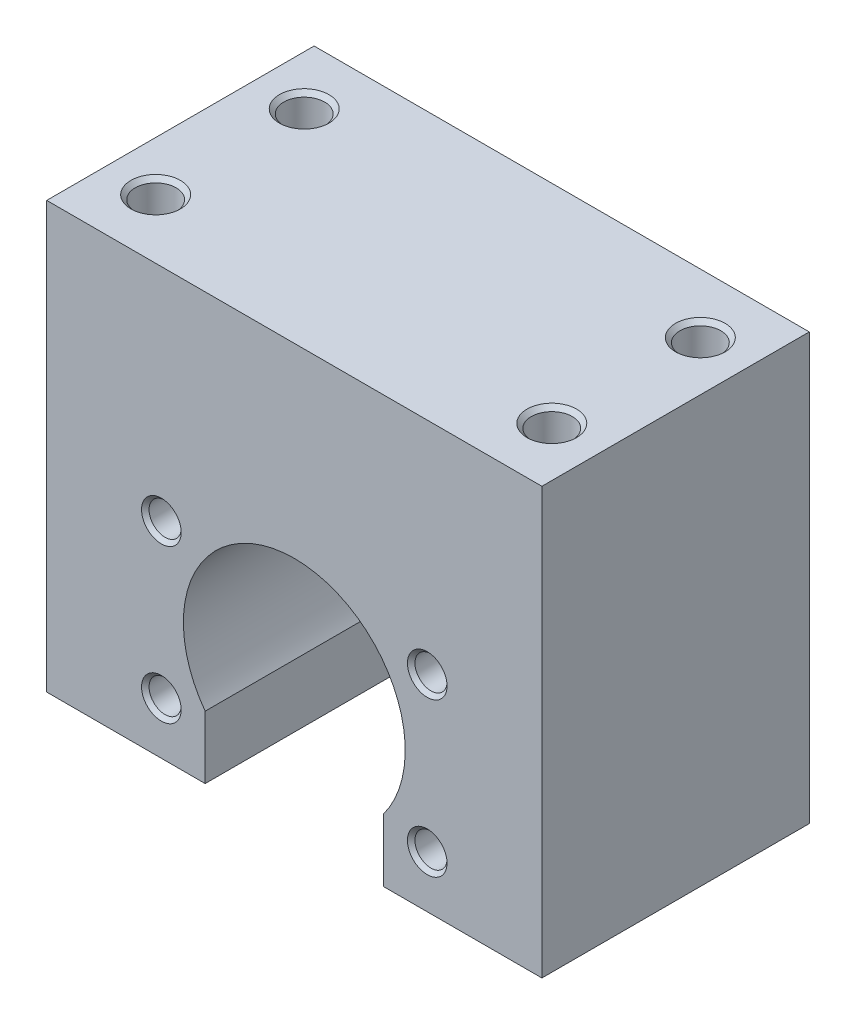
ISO-10303-21;
HEADER;
FILE_DESCRIPTION(('STEP AP214'),'2;1');
FILE_NAME('part.step','',(''),(''),'','','');
FILE_SCHEMA(('AUTOMOTIVE_DESIGN { 1 0 10303 214 1 1 1 1 }'));
ENDSEC;
DATA;
#1=APPLICATION_CONTEXT('core data for automotive mechanical design processes');
#2=APPLICATION_PROTOCOL_DEFINITION('international standard','automotive_design',2000,#1);
#3=PRODUCT_CONTEXT('',#1,'mechanical');
#4=PRODUCT('Part','Part','',(#3));
#5=PRODUCT_RELATED_PRODUCT_CATEGORY('part','',(#4));
#6=PRODUCT_DEFINITION_FORMATION('','',#4);
#7=PRODUCT_DEFINITION_CONTEXT('part definition',#1,'design');
#8=PRODUCT_DEFINITION('design','',#6,#7);
#9=PRODUCT_DEFINITION_SHAPE('','',#8);
#10=(LENGTH_UNIT() NAMED_UNIT(*) SI_UNIT(.MILLI.,.METRE.));
#11=(NAMED_UNIT(*) PLANE_ANGLE_UNIT() SI_UNIT($,.RADIAN.));
#12=(NAMED_UNIT(*) SI_UNIT($,.STERADIAN.) SOLID_ANGLE_UNIT());
#13=UNCERTAINTY_MEASURE_WITH_UNIT(LENGTH_MEASURE(1.E-05),#10,'distance_accuracy_value','');
#14=(GEOMETRIC_REPRESENTATION_CONTEXT(3) GLOBAL_UNCERTAINTY_ASSIGNED_CONTEXT((#13)) GLOBAL_UNIT_ASSIGNED_CONTEXT((#10,
#11,#12)) REPRESENTATION_CONTEXT('',''));
#15=CARTESIAN_POINT('',(0.,0.,0.));
#16=DIRECTION('',(0.,0.,1.));
#17=DIRECTION('',(1.,0.,0.));
#18=AXIS2_PLACEMENT_3D('',#15,#16,#17);
#19=CARTESIAN_POINT('',(13.4233937586588,7.75,5.09999999991351));
#20=DIRECTION('',(0.,0.,1.));
#21=DIRECTION('',(1.,0.,0.));
#22=AXIS2_PLACEMENT_3D('',#19,#20,#21);
#23=CONICAL_SURFACE('',#22,1.62099999988927,1.04719755106381);
#24=CARTESIAN_POINT('',(13.4233937586588,7.75,4.16411521354121));
#25=VERTEX_POINT('',#24);
#26=VERTEX_LOOP('',#25);
#27=FACE_BOUND('',#26,.T.);
#28=CARTESIAN_POINT('',(13.4233937586588,7.75,5.1));
#29=DIRECTION('',(0.,0.,-1.));
#30=DIRECTION('',(-1.,0.,0.));
#31=AXIS2_PLACEMENT_3D('',#28,#29,#30);
#32=CIRCLE('',#31,1.621);
#33=CARTESIAN_POINT('',(11.8023937586588,7.75,5.1));
#34=VERTEX_POINT('',#33);
#35=EDGE_CURVE('E208',#34,#34,#32,.F.);
#36=ORIENTED_EDGE('',*,*,#35,.T.);
#37=EDGE_LOOP('',(#36));
#38=FACE_BOUND('',#37,.T.);
#39=ADVANCED_FACE('F15',(#27,#38),#23,.F.);
#40=CARTESIAN_POINT('',(-13.4233937586588,-7.75,5.10000000002719));
#41=DIRECTION('',(0.,0.,1.));
#42=DIRECTION('',(1.,0.,0.));
#43=AXIS2_PLACEMENT_3D('',#40,#41,#42);
#44=CONICAL_SURFACE('',#43,1.62099999995522,1.04719755119714);
#45=CARTESIAN_POINT('',(-13.4233937586588,-7.75,4.16411521376858));
#46=VERTEX_POINT('',#45);
#47=VERTEX_LOOP('',#46);
#48=FACE_BOUND('',#47,.T.);
#49=CARTESIAN_POINT('',(-13.4233937586588,-7.75,5.1));
#50=DIRECTION('',(0.,0.,-1.));
#51=DIRECTION('',(-1.,0.,0.));
#52=AXIS2_PLACEMENT_3D('',#49,#50,#51);
#53=CIRCLE('',#52,1.621);
#54=CARTESIAN_POINT('',(-15.0443937586588,-7.75,5.1));
#55=VERTEX_POINT('',#54);
#56=EDGE_CURVE('E205',#55,#55,#53,.F.);
#57=ORIENTED_EDGE('',*,*,#56,.T.);
#58=EDGE_LOOP('',(#57));
#59=FACE_BOUND('',#58,.T.);
#60=ADVANCED_FACE('F253',(#48,#59),#44,.F.);
#61=CARTESIAN_POINT('',(13.4233937586588,-7.75,5.09999999997035));
#62=DIRECTION('',(0.,0.,1.));
#63=DIRECTION('',(1.,0.,0.));
#64=AXIS2_PLACEMENT_3D('',#61,#62,#63);
#65=CONICAL_SURFACE('',#64,1.6209999999385,1.04719755118681);
#66=CARTESIAN_POINT('',(13.4233937586588,-7.75,4.1641152136549));
#67=VERTEX_POINT('',#66);
#68=VERTEX_LOOP('',#67);
#69=FACE_BOUND('',#68,.T.);
#70=CARTESIAN_POINT('',(13.4233937586588,-7.75,5.1));
#71=DIRECTION('',(0.,0.,-1.));
#72=DIRECTION('',(-1.,0.,0.));
#73=AXIS2_PLACEMENT_3D('',#70,#71,#72);
#74=CIRCLE('',#73,1.621);
#75=CARTESIAN_POINT('',(11.8023937586588,-7.75,5.1));
#76=VERTEX_POINT('',#75);
#77=EDGE_CURVE('E202',#76,#76,#74,.F.);
#78=ORIENTED_EDGE('',*,*,#77,.T.);
#79=EDGE_LOOP('',(#78));
#80=FACE_BOUND('',#79,.T.);
#81=ADVANCED_FACE('F259',(#69,#80),#65,.F.);
#82=CARTESIAN_POINT('',(-13.4233937586588,7.75,5.10000000002719));
#83=DIRECTION('',(0.,0.,1.));
#84=DIRECTION('',(1.,0.,0.));
#85=AXIS2_PLACEMENT_3D('',#82,#83,#84);
#86=CONICAL_SURFACE('',#85,1.62099999995522,1.04719755119714);
#87=CARTESIAN_POINT('',(-13.4233937586588,7.75,4.16411521376858));
#88=VERTEX_POINT('',#87);
#89=VERTEX_LOOP('',#88);
#90=FACE_BOUND('',#89,.T.);
#91=CARTESIAN_POINT('',(-13.4233937586588,7.75,5.1));
#92=DIRECTION('',(0.,0.,-1.));
#93=DIRECTION('',(-1.,0.,0.));
#94=AXIS2_PLACEMENT_3D('',#91,#92,#93);
#95=CIRCLE('',#94,1.621);
#96=CARTESIAN_POINT('',(-15.0443937586588,7.75,5.1));
#97=VERTEX_POINT('',#96);
#98=EDGE_CURVE('E199',#97,#97,#95,.F.);
#99=ORIENTED_EDGE('',*,*,#98,.T.);
#100=EDGE_LOOP('',(#99));
#101=FACE_BOUND('',#100,.T.);
#102=ADVANCED_FACE('F365',(#90,#101),#86,.F.);
#103=CARTESIAN_POINT('',(20.,18.0000000000291,-7.5));
#104=DIRECTION('',(0.,1.,0.));
#105=DIRECTION('',(0.,0.,1.));
#106=AXIS2_PLACEMENT_3D('',#103,#104,#105);
#107=CONICAL_SURFACE('',#106,2.06699999994726,1.04719755119768);
#108=CARTESIAN_POINT('',(20.,16.8066169935912,-7.50000000013529));
#109=VERTEX_POINT('',#108);
#110=VERTEX_LOOP('',#109);
#111=FACE_BOUND('',#110,.T.);
#112=CARTESIAN_POINT('',(20.,18.,-7.5));
#113=DIRECTION('',(0.,-1.,0.));
#114=DIRECTION('',(0.,0.,-1.));
#115=AXIS2_PLACEMENT_3D('',#112,#113,#114);
#116=CIRCLE('',#115,2.067);
#117=CARTESIAN_POINT('',(20.,18.,-9.567));
#118=VERTEX_POINT('',#117);
#119=EDGE_CURVE('E196',#118,#118,#116,.F.);
#120=ORIENTED_EDGE('',*,*,#119,.T.);
#121=EDGE_LOOP('',(#120));
#122=FACE_BOUND('',#121,.T.);
#123=ADVANCED_FACE('F361',(#111,#122),#107,.F.);
#124=CARTESIAN_POINT('',(20.,18.0000000000291,7.5));
#125=DIRECTION('',(0.,1.,0.));
#126=DIRECTION('',(0.,0.,1.));
#127=AXIS2_PLACEMENT_3D('',#124,#125,#126);
#128=CONICAL_SURFACE('',#127,2.06699999994726,1.04719755119768);
#129=CARTESIAN_POINT('',(20.,16.8066169935912,7.50000000013529));
#130=VERTEX_POINT('',#129);
#131=VERTEX_LOOP('',#130);
#132=FACE_BOUND('',#131,.T.);
#133=CARTESIAN_POINT('',(20.,18.,7.5));
#134=DIRECTION('',(0.,1.,0.));
#135=DIRECTION('',(0.,0.,1.));
#136=AXIS2_PLACEMENT_3D('',#133,#134,#135);
#137=CIRCLE('',#136,2.067);
#138=CARTESIAN_POINT('',(20.,18.,9.567));
#139=VERTEX_POINT('',#138);
#140=EDGE_CURVE('E193',#139,#139,#137,.T.);
#141=ORIENTED_EDGE('',*,*,#140,.T.);
#142=EDGE_LOOP('',(#141));
#143=FACE_BOUND('',#142,.T.);
#144=ADVANCED_FACE('F357',(#132,#143),#128,.F.);
#145=CARTESIAN_POINT('',(-20.,18.0000000000291,-7.5));
#146=DIRECTION('',(0.,1.,0.));
#147=DIRECTION('',(0.,0.,1.));
#148=AXIS2_PLACEMENT_3D('',#145,#146,#147);
#149=CONICAL_SURFACE('',#148,2.06699999994726,1.04719755119768);
#150=CARTESIAN_POINT('',(-20.,16.8066169935912,-7.50000000013529));
#151=VERTEX_POINT('',#150);
#152=VERTEX_LOOP('',#151);
#153=FACE_BOUND('',#152,.T.);
#154=CARTESIAN_POINT('',(-20.,18.,-7.5));
#155=DIRECTION('',(0.,-1.,0.));
#156=DIRECTION('',(0.,0.,-1.));
#157=AXIS2_PLACEMENT_3D('',#154,#155,#156);
#158=CIRCLE('',#157,2.067);
#159=CARTESIAN_POINT('',(-20.,18.,-9.567));
#160=VERTEX_POINT('',#159);
#161=EDGE_CURVE('E190',#160,#160,#158,.F.);
#162=ORIENTED_EDGE('',*,*,#161,.T.);
#163=EDGE_LOOP('',(#162));
#164=FACE_BOUND('',#163,.T.);
#165=ADVANCED_FACE('F353',(#153,#164),#149,.F.);
#166=CARTESIAN_POINT('',(-20.,18.0000000000291,7.5));
#167=DIRECTION('',(0.,1.,0.));
#168=DIRECTION('',(0.,0.,1.));
#169=AXIS2_PLACEMENT_3D('',#166,#167,#168);
#170=CONICAL_SURFACE('',#169,2.06699999994726,1.04719755119768);
#171=CARTESIAN_POINT('',(-20.,16.8066169935912,7.50000000013529));
#172=VERTEX_POINT('',#171);
#173=VERTEX_LOOP('',#172);
#174=FACE_BOUND('',#173,.T.);
#175=CARTESIAN_POINT('',(-20.,18.,7.5));
#176=DIRECTION('',(0.,1.,0.));
#177=DIRECTION('',(0.,0.,1.));
#178=AXIS2_PLACEMENT_3D('',#175,#176,#177);
#179=CIRCLE('',#178,2.067);
#180=CARTESIAN_POINT('',(-20.,18.,9.567));
#181=VERTEX_POINT('',#180);
#182=EDGE_CURVE('E187',#181,#181,#179,.T.);
#183=ORIENTED_EDGE('',*,*,#182,.T.);
#184=EDGE_LOOP('',(#183));
#185=FACE_BOUND('',#184,.T.);
#186=ADVANCED_FACE('F248',(#174,#185),#170,.F.);
#187=CARTESIAN_POINT('',(13.4233937586588,7.75,9.1105));
#188=DIRECTION('',(0.,0.,-1.));
#189=DIRECTION('',(-1.,0.,0.));
#190=AXIS2_PLACEMENT_3D('',#187,#188,#189);
#191=CYLINDRICAL_SURFACE('',#190,1.621);
#192=CARTESIAN_POINT('',(13.4233937586588,7.75,13.1210000000124));
#193=DIRECTION('',(0.,0.,1.));
#194=DIRECTION('',(-0.866025403782762,-0.500000000002904,0.));
#195=AXIS2_PLACEMENT_3D('',#192,#193,#194);
#196=CIRCLE('',#195,1.62100000001615);
#197=CARTESIAN_POINT('',(12.019566579113,6.93949999998722,13.1210000000124));
#198=VERTEX_POINT('',#197);
#199=EDGE_CURVE('E184',#198,#198,#196,.T.);
#200=ORIENTED_EDGE('',*,*,#199,.T.);
#201=EDGE_LOOP('',(#200));
#202=FACE_BOUND('',#201,.T.);
#203=ORIENTED_EDGE('',*,*,#35,.F.);
#204=EDGE_LOOP('',(#203));
#205=FACE_BOUND('',#204,.T.);
#206=ADVANCED_FACE('F244',(#202,#205),#191,.F.);
#207=CARTESIAN_POINT('',(-13.4233937586588,-7.75,9.1105));
#208=DIRECTION('',(0.,0.,-1.));
#209=DIRECTION('',(-1.,0.,0.));
#210=AXIS2_PLACEMENT_3D('',#207,#208,#209);
#211=CYLINDRICAL_SURFACE('',#210,1.621);
#212=CARTESIAN_POINT('',(-13.4233937586588,-7.75,13.1209999999555));
#213=DIRECTION('',(0.,0.,1.));
#214=DIRECTION('',(-0.866025403784687,-0.49999999999957,0.));
#215=AXIS2_PLACEMENT_3D('',#212,#213,#214);
#216=CIRCLE('',#215,1.62099999997602);
#217=CARTESIAN_POINT('',(-14.827220938173,-8.56049999998731,13.1209999999555));
#218=VERTEX_POINT('',#217);
#219=EDGE_CURVE('E181',#218,#218,#216,.T.);
#220=ORIENTED_EDGE('',*,*,#219,.T.);
#221=EDGE_LOOP('',(#220));
#222=FACE_BOUND('',#221,.T.);
#223=ORIENTED_EDGE('',*,*,#56,.F.);
#224=EDGE_LOOP('',(#223));
#225=FACE_BOUND('',#224,.T.);
#226=ADVANCED_FACE('F247',(#222,#225),#211,.F.);
#227=CARTESIAN_POINT('',(13.4233937586588,-7.75,9.1105));
#228=DIRECTION('',(0.,0.,-1.));
#229=DIRECTION('',(-1.,0.,0.));
#230=AXIS2_PLACEMENT_3D('',#227,#228,#229);
#231=CYLINDRICAL_SURFACE('',#230,1.621);
#232=CARTESIAN_POINT('',(13.4233937586588,-7.75,13.1210000000124));
#233=DIRECTION('',(0.,0.,1.));
#234=DIRECTION('',(-0.866025403782762,0.500000000002904,0.));
#235=AXIS2_PLACEMENT_3D('',#232,#233,#234);
#236=CIRCLE('',#235,1.62100000001615);
#237=CARTESIAN_POINT('',(12.019566579113,-6.93949999998722,13.1210000000124));
#238=VERTEX_POINT('',#237);
#239=EDGE_CURVE('E178',#238,#238,#236,.T.);
#240=ORIENTED_EDGE('',*,*,#239,.T.);
#241=EDGE_LOOP('',(#240));
#242=FACE_BOUND('',#241,.T.);
#243=ORIENTED_EDGE('',*,*,#77,.F.);
#244=EDGE_LOOP('',(#243));
#245=FACE_BOUND('',#244,.T.);
#246=ADVANCED_FACE('F343',(#242,#245),#231,.F.);
#247=CARTESIAN_POINT('',(-13.4233937586588,7.75,9.1105));
#248=DIRECTION('',(0.,0.,-1.));
#249=DIRECTION('',(-1.,0.,0.));
#250=AXIS2_PLACEMENT_3D('',#247,#248,#249);
#251=CYLINDRICAL_SURFACE('',#250,1.621);
#252=CARTESIAN_POINT('',(-13.4233937586588,7.75,13.1209999999555));
#253=DIRECTION('',(0.,0.,1.));
#254=DIRECTION('',(-0.866025403784687,0.49999999999957,0.));
#255=AXIS2_PLACEMENT_3D('',#252,#253,#254);
#256=CIRCLE('',#255,1.62099999997602);
#257=CARTESIAN_POINT('',(-14.827220938173,8.56049999998731,13.1209999999555));
#258=VERTEX_POINT('',#257);
#259=EDGE_CURVE('E175',#258,#258,#256,.T.);
#260=ORIENTED_EDGE('',*,*,#259,.T.);
#261=EDGE_LOOP('',(#260));
#262=FACE_BOUND('',#261,.T.);
#263=ORIENTED_EDGE('',*,*,#98,.F.);
#264=EDGE_LOOP('',(#263));
#265=FACE_BOUND('',#264,.T.);
#266=ADVANCED_FACE('F339',(#262,#265),#251,.F.);
#267=CARTESIAN_POINT('',(20.,23.7835,-7.5));
#268=DIRECTION('',(0.,-1.,0.));
#269=DIRECTION('',(0.,0.,-1.));
#270=AXIS2_PLACEMENT_3D('',#267,#268,#269);
#271=CYLINDRICAL_SURFACE('',#270,2.067);
#272=CARTESIAN_POINT('',(20.,29.5669999999291,-7.5));
#273=DIRECTION('',(0.,1.,0.));
#274=DIRECTION('',(0.,0.,-1.));
#275=AXIS2_PLACEMENT_3D('',#272,#273,#274);
#276=CIRCLE('',#275,2.06699999994726);
#277=CARTESIAN_POINT('',(20.,29.5669999999291,-9.56699999994726));
#278=VERTEX_POINT('',#277);
#279=EDGE_CURVE('E172',#278,#278,#276,.T.);
#280=ORIENTED_EDGE('',*,*,#279,.T.);
#281=EDGE_LOOP('',(#280));
#282=FACE_BOUND('',#281,.T.);
#283=ORIENTED_EDGE('',*,*,#119,.F.);
#284=EDGE_LOOP('',(#283));
#285=FACE_BOUND('',#284,.T.);
#286=ADVANCED_FACE('F335',(#282,#285),#271,.F.);
#287=CARTESIAN_POINT('',(20.,23.7835,7.5));
#288=DIRECTION('',(0.,1.,0.));
#289=DIRECTION('',(0.,0.,1.));
#290=AXIS2_PLACEMENT_3D('',#287,#288,#289);
#291=CYLINDRICAL_SURFACE('',#290,2.067);
#292=CARTESIAN_POINT('',(20.,29.5669999999291,7.5));
#293=DIRECTION('',(0.,1.,0.));
#294=DIRECTION('',(0.,0.,1.));
#295=AXIS2_PLACEMENT_3D('',#292,#293,#294);
#296=CIRCLE('',#295,2.06699999994726);
#297=CARTESIAN_POINT('',(20.,29.5669999999291,9.56699999994726));
#298=VERTEX_POINT('',#297);
#299=EDGE_CURVE('E169',#298,#298,#296,.T.);
#300=ORIENTED_EDGE('',*,*,#299,.T.);
#301=EDGE_LOOP('',(#300));
#302=FACE_BOUND('',#301,.T.);
#303=ORIENTED_EDGE('',*,*,#140,.F.);
#304=EDGE_LOOP('',(#303));
#305=FACE_BOUND('',#304,.T.);
#306=ADVANCED_FACE('F331',(#302,#305),#291,.F.);
#307=CARTESIAN_POINT('',(-20.,23.7835,-7.5));
#308=DIRECTION('',(0.,-1.,0.));
#309=DIRECTION('',(0.,0.,-1.));
#310=AXIS2_PLACEMENT_3D('',#307,#308,#309);
#311=CYLINDRICAL_SURFACE('',#310,2.067);
#312=CARTESIAN_POINT('',(-20.,29.5669999999291,-7.5));
#313=DIRECTION('',(0.,1.,0.));
#314=DIRECTION('',(0.,0.,-1.));
#315=AXIS2_PLACEMENT_3D('',#312,#313,#314);
#316=CIRCLE('',#315,2.06699999994726);
#317=CARTESIAN_POINT('',(-20.,29.5669999999291,-9.56699999994726));
#318=VERTEX_POINT('',#317);
#319=EDGE_CURVE('E166',#318,#318,#316,.T.);
#320=ORIENTED_EDGE('',*,*,#319,.T.);
#321=EDGE_LOOP('',(#320));
#322=FACE_BOUND('',#321,.T.);
#323=ORIENTED_EDGE('',*,*,#161,.F.);
#324=EDGE_LOOP('',(#323));
#325=FACE_BOUND('',#324,.T.);
#326=ADVANCED_FACE('F327',(#322,#325),#311,.F.);
#327=CARTESIAN_POINT('',(-20.,23.7835,7.5));
#328=DIRECTION('',(0.,1.,0.));
#329=DIRECTION('',(0.,0.,1.));
#330=AXIS2_PLACEMENT_3D('',#327,#328,#329);
#331=CYLINDRICAL_SURFACE('',#330,2.067);
#332=CARTESIAN_POINT('',(-20.,29.5669999999291,7.5));
#333=DIRECTION('',(0.,1.,0.));
#334=DIRECTION('',(0.,0.,1.));
#335=AXIS2_PLACEMENT_3D('',#332,#333,#334);
#336=CIRCLE('',#335,2.06699999994726);
#337=CARTESIAN_POINT('',(-20.,29.5669999999291,9.56699999994726));
#338=VERTEX_POINT('',#337);
#339=EDGE_CURVE('E163',#338,#338,#336,.T.);
#340=ORIENTED_EDGE('',*,*,#339,.T.);
#341=EDGE_LOOP('',(#340));
#342=FACE_BOUND('',#341,.T.);
#343=ORIENTED_EDGE('',*,*,#182,.F.);
#344=EDGE_LOOP('',(#343));
#345=FACE_BOUND('',#344,.T.);
#346=ADVANCED_FACE('F240',(#342,#345),#331,.F.);
#347=CARTESIAN_POINT('',(13.4233937586588,7.75,13.499999999965));
#348=DIRECTION('',(0.,0.,1.));
#349=DIRECTION('',(0.,-1.,0.));
#350=AXIS2_PLACEMENT_3D('',#347,#348,#349);
#351=CONICAL_SURFACE('',#350,1.99999999991365,0.785398163352202);
#352=CARTESIAN_POINT('',(13.4233937586588,7.75,13.5000000000218));
#353=DIRECTION('',(0.,0.,1.));
#354=DIRECTION('',(0.,-1.,0.));
#355=AXIS2_PLACEMENT_3D('',#352,#353,#354);
#356=CIRCLE('',#355,1.9999999999705);
#357=CARTESIAN_POINT('',(13.4233937586588,5.7500000000295,13.5000000000218));
#358=VERTEX_POINT('',#357);
#359=EDGE_CURVE('E18',#358,#358,#356,.F.);
#360=ORIENTED_EDGE('',*,*,#359,.F.);
#361=EDGE_LOOP('',(#360));
#362=FACE_BOUND('',#361,.T.);
#363=ORIENTED_EDGE('',*,*,#199,.F.);
#364=EDGE_LOOP('',(#363));
#365=FACE_BOUND('',#364,.T.);
#366=ADVANCED_FACE('F236',(#362,#365),#351,.F.);
#367=CARTESIAN_POINT('',(-13.4233937586588,-7.75,13.499999999965));
#368=DIRECTION('',(0.,0.,1.));
#369=DIRECTION('',(0.,-1.,0.));
#370=AXIS2_PLACEMENT_3D('',#367,#368,#369);
#371=CONICAL_SURFACE('',#370,2.00000000000041,0.785398163417146);
#372=CARTESIAN_POINT('',(-13.4233937586588,-7.75,13.499999999965));
#373=DIRECTION('',(0.,0.,1.));
#374=DIRECTION('',(0.,-1.,0.));
#375=AXIS2_PLACEMENT_3D('',#372,#373,#374);
#376=CIRCLE('',#375,2.00000000000041);
#377=CARTESIAN_POINT('',(-13.4233937586588,-9.75000000000041,13.499999999965));
#378=VERTEX_POINT('',#377);
#379=EDGE_CURVE('E228',#378,#378,#376,.F.);
#380=ORIENTED_EDGE('',*,*,#379,.F.);
#381=EDGE_LOOP('',(#380));
#382=FACE_BOUND('',#381,.T.);
#383=ORIENTED_EDGE('',*,*,#219,.F.);
#384=EDGE_LOOP('',(#383));
#385=FACE_BOUND('',#384,.T.);
#386=ADVANCED_FACE('F239',(#382,#385),#371,.F.);
#387=CARTESIAN_POINT('',(13.4233937586588,-7.75,13.499999999965));
#388=DIRECTION('',(0.,0.,1.));
#389=DIRECTION('',(0.,-1.,0.));
#390=AXIS2_PLACEMENT_3D('',#387,#388,#389);
#391=CONICAL_SURFACE('',#390,1.99999999991365,0.785398163352202);
#392=CARTESIAN_POINT('',(13.4233937586588,-7.75,13.5000000000218));
#393=DIRECTION('',(0.,0.,1.));
#394=DIRECTION('',(0.,-1.,0.));
#395=AXIS2_PLACEMENT_3D('',#392,#393,#394);
#396=CIRCLE('',#395,1.9999999999705);
#397=CARTESIAN_POINT('',(13.4233937586588,-9.7499999999705,13.5000000000218));
#398=VERTEX_POINT('',#397);
#399=EDGE_CURVE('E226',#398,#398,#396,.F.);
#400=ORIENTED_EDGE('',*,*,#399,.F.);
#401=EDGE_LOOP('',(#400));
#402=FACE_BOUND('',#401,.T.);
#403=ORIENTED_EDGE('',*,*,#239,.F.);
#404=EDGE_LOOP('',(#403));
#405=FACE_BOUND('',#404,.T.);
#406=ADVANCED_FACE('F317',(#402,#405),#391,.F.);
#407=CARTESIAN_POINT('',(-13.4233937586588,7.75,13.499999999965));
#408=DIRECTION('',(0.,0.,1.));
#409=DIRECTION('',(0.,-1.,0.));
#410=AXIS2_PLACEMENT_3D('',#407,#408,#409);
#411=CONICAL_SURFACE('',#410,2.00000000000041,0.785398163417146);
#412=CARTESIAN_POINT('',(-13.4233937586588,7.75,13.499999999965));
#413=DIRECTION('',(0.,0.,1.));
#414=DIRECTION('',(0.,-1.,0.));
#415=AXIS2_PLACEMENT_3D('',#412,#413,#414);
#416=CIRCLE('',#415,2.00000000000041);
#417=CARTESIAN_POINT('',(-13.4233937586588,5.74999999999959,13.499999999965));
#418=VERTEX_POINT('',#417);
#419=EDGE_CURVE('E123',#418,#418,#416,.F.);
#420=ORIENTED_EDGE('',*,*,#419,.F.);
#421=EDGE_LOOP('',(#420));
#422=FACE_BOUND('',#421,.T.);
#423=ORIENTED_EDGE('',*,*,#259,.F.);
#424=EDGE_LOOP('',(#423));
#425=FACE_BOUND('',#424,.T.);
#426=ADVANCED_FACE('F313',(#422,#425),#411,.F.);
#427=CARTESIAN_POINT('',(20.,29.999999999859,-7.5));
#428=DIRECTION('',(0.,1.,0.));
#429=DIRECTION('',(-1.,0.,0.));
#430=AXIS2_PLACEMENT_3D('',#427,#428,#429);
#431=CONICAL_SURFACE('',#430,2.49999999987722,0.785398163397448);
#432=CARTESIAN_POINT('',(20.,29.9999999999727,-7.5));
#433=DIRECTION('',(0.,1.,0.));
#434=DIRECTION('',(-1.,0.,0.));
#435=AXIS2_PLACEMENT_3D('',#432,#433,#434);
#436=CIRCLE('',#435,2.49999999999091);
#437=CARTESIAN_POINT('',(17.5000000000091,29.9999999999727,-7.5));
#438=VERTEX_POINT('',#437);
#439=EDGE_CURVE('E221',#438,#438,#436,.F.);
#440=ORIENTED_EDGE('',*,*,#439,.F.);
#441=EDGE_LOOP('',(#440));
#442=FACE_BOUND('',#441,.T.);
#443=ORIENTED_EDGE('',*,*,#279,.F.);
#444=EDGE_LOOP('',(#443));
#445=FACE_BOUND('',#444,.T.);
#446=ADVANCED_FACE('F309',(#442,#445),#431,.F.);
#447=CARTESIAN_POINT('',(20.,29.999999999859,7.5));
#448=DIRECTION('',(0.,1.,0.));
#449=DIRECTION('',(-1.,0.,0.));
#450=AXIS2_PLACEMENT_3D('',#447,#448,#449);
#451=CONICAL_SURFACE('',#450,2.49999999987722,0.785398163397448);
#452=CARTESIAN_POINT('',(20.,29.9999999999727,7.5));
#453=DIRECTION('',(0.,1.,0.));
#454=DIRECTION('',(-1.,0.,0.));
#455=AXIS2_PLACEMENT_3D('',#452,#453,#454);
#456=CIRCLE('',#455,2.49999999999091);
#457=CARTESIAN_POINT('',(17.5000000000091,29.9999999999727,7.5));
#458=VERTEX_POINT('',#457);
#459=EDGE_CURVE('E218',#458,#458,#456,.F.);
#460=ORIENTED_EDGE('',*,*,#459,.F.);
#461=EDGE_LOOP('',(#460));
#462=FACE_BOUND('',#461,.T.);
#463=ORIENTED_EDGE('',*,*,#299,.F.);
#464=EDGE_LOOP('',(#463));
#465=FACE_BOUND('',#464,.T.);
#466=ADVANCED_FACE('F305',(#462,#465),#451,.F.);
#467=CARTESIAN_POINT('',(-20.,29.999999999859,-7.5));
#468=DIRECTION('',(0.,1.,0.));
#469=DIRECTION('',(-1.,0.,0.));
#470=AXIS2_PLACEMENT_3D('',#467,#468,#469);
#471=CONICAL_SURFACE('',#470,2.49999999987722,0.785398163397448);
#472=CARTESIAN_POINT('',(-20.,29.9999999999727,-7.5));
#473=DIRECTION('',(0.,1.,0.));
#474=DIRECTION('',(-1.,0.,0.));
#475=AXIS2_PLACEMENT_3D('',#472,#473,#474);
#476=CIRCLE('',#475,2.49999999999091);
#477=CARTESIAN_POINT('',(-22.4999999999909,29.9999999999727,-7.5));
#478=VERTEX_POINT('',#477);
#479=EDGE_CURVE('E215',#478,#478,#476,.F.);
#480=ORIENTED_EDGE('',*,*,#479,.F.);
#481=EDGE_LOOP('',(#480));
#482=FACE_BOUND('',#481,.T.);
#483=ORIENTED_EDGE('',*,*,#319,.F.);
#484=EDGE_LOOP('',(#483));
#485=FACE_BOUND('',#484,.T.);
#486=ADVANCED_FACE('F301',(#482,#485),#471,.F.);
#487=CARTESIAN_POINT('',(-20.,29.999999999859,7.5));
#488=DIRECTION('',(0.,1.,0.));
#489=DIRECTION('',(-1.,0.,0.));
#490=AXIS2_PLACEMENT_3D('',#487,#488,#489);
#491=CONICAL_SURFACE('',#490,2.49999999987722,0.785398163397448);
#492=CARTESIAN_POINT('',(-20.,29.9999999999727,7.5));
#493=DIRECTION('',(0.,1.,0.));
#494=DIRECTION('',(-1.,0.,0.));
#495=AXIS2_PLACEMENT_3D('',#492,#493,#494);
#496=CIRCLE('',#495,2.49999999999091);
#497=CARTESIAN_POINT('',(-22.4999999999909,29.9999999999727,7.5));
#498=VERTEX_POINT('',#497);
#499=EDGE_CURVE('E151',#498,#498,#496,.F.);
#500=ORIENTED_EDGE('',*,*,#499,.F.);
#501=EDGE_LOOP('',(#500));
#502=FACE_BOUND('',#501,.T.);
#503=ORIENTED_EDGE('',*,*,#339,.F.);
#504=EDGE_LOOP('',(#503));
#505=FACE_BOUND('',#504,.T.);
#506=ADVANCED_FACE('F298',(#502,#505),#491,.F.);
#507=CARTESIAN_POINT('',(0.,0.,13.5));
#508=DIRECTION('',(0.,0.,1.));
#509=DIRECTION('',(1.,0.,0.));
#510=AXIS2_PLACEMENT_3D('',#507,#508,#509);
#511=PLANE('',#510);
#512=DIRECTION('',(1.,0.,0.));
#513=VECTOR('',#512,1.);
#514=CARTESIAN_POINT('',(25.,30.,13.5));
#515=LINE('',#514,#513);
#516=CARTESIAN_POINT('',(-25.,30.,13.5));
#517=VERTEX_POINT('',#516);
#518=CARTESIAN_POINT('',(25.,30.,13.5));
#519=VERTEX_POINT('',#518);
#520=EDGE_CURVE('E149',#517,#519,#515,.T.);
#521=ORIENTED_EDGE('',*,*,#520,.F.);
#522=DIRECTION('',(0.,1.,0.));
#523=VECTOR('',#522,1.);
#524=CARTESIAN_POINT('',(-25.,30.,13.5));
#525=LINE('',#524,#523);
#526=CARTESIAN_POINT('',(-25.,-13.,13.5));
#527=VERTEX_POINT('',#526);
#528=EDGE_CURVE('E144',#527,#517,#525,.T.);
#529=ORIENTED_EDGE('',*,*,#528,.F.);
#530=DIRECTION('',(1.,0.,0.));
#531=VECTOR('',#530,1.);
#532=CARTESIAN_POINT('',(-25.,-13.,13.5));
#533=LINE('',#532,#531);
#534=CARTESIAN_POINT('',(-9.,-13.,13.5));
#535=VERTEX_POINT('',#534);
#536=EDGE_CURVE('E134',#535,#527,#533,.F.);
#537=ORIENTED_EDGE('',*,*,#536,.F.);
#538=DIRECTION('',(0.,1.,0.));
#539=VECTOR('',#538,1.);
#540=CARTESIAN_POINT('',(-9.,-13.,13.5));
#541=LINE('',#540,#539);
#542=CARTESIAN_POINT('',(-9.,-6.66633332499958,13.5));
#543=VERTEX_POINT('',#542);
#544=EDGE_CURVE('E119',#543,#535,#541,.F.);
#545=ORIENTED_EDGE('',*,*,#544,.F.);
#546=CARTESIAN_POINT('',(0.,0.,13.5));
#547=DIRECTION('',(0.,0.,1.));
#548=DIRECTION('',(1.,0.,0.));
#549=AXIS2_PLACEMENT_3D('',#546,#547,#548);
#550=CIRCLE('',#549,11.2);
#551=CARTESIAN_POINT('',(9.,-6.66633332499958,13.5));
#552=VERTEX_POINT('',#551);
#553=EDGE_CURVE('E111',#543,#552,#550,.F.);
#554=ORIENTED_EDGE('',*,*,#553,.T.);
#555=DIRECTION('',(0.,1.,0.));
#556=VECTOR('',#555,1.);
#557=CARTESIAN_POINT('',(9.,-6.66633332499958,13.5));
#558=LINE('',#557,#556);
#559=CARTESIAN_POINT('',(9.,-13.,13.5));
#560=VERTEX_POINT('',#559);
#561=EDGE_CURVE('E101',#560,#552,#558,.T.);
#562=ORIENTED_EDGE('',*,*,#561,.F.);
#563=DIRECTION('',(1.,0.,0.));
#564=VECTOR('',#563,1.);
#565=CARTESIAN_POINT('',(9.,-13.,13.5));
#566=LINE('',#565,#564);
#567=CARTESIAN_POINT('',(25.,-13.,13.5));
#568=VERTEX_POINT('',#567);
#569=EDGE_CURVE('E127',#568,#560,#566,.F.);
#570=ORIENTED_EDGE('',*,*,#569,.F.);
#571=DIRECTION('',(0.,1.,0.));
#572=VECTOR('',#571,1.);
#573=CARTESIAN_POINT('',(25.,-13.,13.5));
#574=LINE('',#573,#572);
#575=EDGE_CURVE('E154',#519,#568,#574,.F.);
#576=ORIENTED_EDGE('',*,*,#575,.F.);
#577=EDGE_LOOP('',(#521,#529,#537,#545,#554,#562,#570,#576));
#578=FACE_BOUND('',#577,.T.);
#579=ORIENTED_EDGE('',*,*,#419,.T.);
#580=EDGE_LOOP('',(#579));
#581=FACE_BOUND('',#580,.T.);
#582=ORIENTED_EDGE('',*,*,#399,.T.);
#583=EDGE_LOOP('',(#582));
#584=FACE_BOUND('',#583,.T.);
#585=ORIENTED_EDGE('',*,*,#379,.T.);
#586=EDGE_LOOP('',(#585));
#587=FACE_BOUND('',#586,.T.);
#588=ORIENTED_EDGE('',*,*,#359,.T.);
#589=EDGE_LOOP('',(#588));
#590=FACE_BOUND('',#589,.T.);
#591=ADVANCED_FACE('F116',(#578,#581,#584,#587,#590),#511,.T.);
#592=CARTESIAN_POINT('',(0.,0.,13.5));
#593=DIRECTION('',(0.,0.,1.));
#594=DIRECTION('',(1.,0.,0.));
#595=AXIS2_PLACEMENT_3D('',#592,#593,#594);
#596=CYLINDRICAL_SURFACE('',#595,11.2);
#597=CARTESIAN_POINT('',(0.,0.,-13.5));
#598=DIRECTION('',(0.,0.,1.));
#599=DIRECTION('',(1.,0.,0.));
#600=AXIS2_PLACEMENT_3D('',#597,#598,#599);
#601=CIRCLE('',#600,11.2);
#602=CARTESIAN_POINT('',(-9.,-6.66633332499958,-13.5));
#603=VERTEX_POINT('',#602);
#604=CARTESIAN_POINT('',(9.,-6.66633332499958,-13.5));
#605=VERTEX_POINT('',#604);
#606=EDGE_CURVE('E126',#603,#605,#601,.F.);
#607=ORIENTED_EDGE('',*,*,#606,.T.);
#608=DIRECTION('',(0.,0.,1.));
#609=VECTOR('',#608,1.);
#610=CARTESIAN_POINT('',(9.,-6.66633332499958,13.5));
#611=LINE('',#610,#609);
#612=EDGE_CURVE('E106',#552,#605,#611,.F.);
#613=ORIENTED_EDGE('',*,*,#612,.F.);
#614=ORIENTED_EDGE('',*,*,#553,.F.);
#615=DIRECTION('',(0.,0.,-1.));
#616=VECTOR('',#615,1.);
#617=CARTESIAN_POINT('',(-9.,-6.66633332499958,13.5));
#618=LINE('',#617,#616);
#619=EDGE_CURVE('E141',#603,#543,#618,.F.);
#620=ORIENTED_EDGE('',*,*,#619,.F.);
#621=EDGE_LOOP('',(#607,#613,#614,#620));
#622=FACE_BOUND('',#621,.T.);
#623=ADVANCED_FACE('F125',(#622),#596,.F.);
#624=CARTESIAN_POINT('',(9.,-6.66633332499958,13.5));
#625=DIRECTION('',(-1.,0.,0.));
#626=DIRECTION('',(0.,0.,1.));
#627=AXIS2_PLACEMENT_3D('',#624,#625,#626);
#628=PLANE('',#627);
#629=ORIENTED_EDGE('',*,*,#561,.T.);
#630=ORIENTED_EDGE('',*,*,#612,.T.);
#631=DIRECTION('',(0.,1.,0.));
#632=VECTOR('',#631,1.);
#633=CARTESIAN_POINT('',(9.,0.,-13.5));
#634=LINE('',#633,#632);
#635=CARTESIAN_POINT('',(9.,-13.,-13.5));
#636=VERTEX_POINT('',#635);
#637=EDGE_CURVE('E212',#605,#636,#634,.F.);
#638=ORIENTED_EDGE('',*,*,#637,.T.);
#639=DIRECTION('',(0.,0.,-1.));
#640=VECTOR('',#639,1.);
#641=CARTESIAN_POINT('',(9.,-13.,13.5));
#642=LINE('',#641,#640);
#643=EDGE_CURVE('E108',#560,#636,#642,.T.);
#644=ORIENTED_EDGE('',*,*,#643,.F.);
#645=EDGE_LOOP('',(#629,#630,#638,#644));
#646=FACE_BOUND('',#645,.T.);
#647=ADVANCED_FACE('F103',(#646),#628,.T.);
#648=CARTESIAN_POINT('',(9.,-13.,13.5));
#649=DIRECTION('',(0.,-1.,0.));
#650=DIRECTION('',(0.,0.,-1.));
#651=AXIS2_PLACEMENT_3D('',#648,#649,#650);
#652=PLANE('',#651);
#653=ORIENTED_EDGE('',*,*,#569,.T.);
#654=ORIENTED_EDGE('',*,*,#643,.T.);
#655=DIRECTION('',(1.,0.,0.));
#656=VECTOR('',#655,1.);
#657=CARTESIAN_POINT('',(0.,-13.,-13.5));
#658=LINE('',#657,#656);
#659=CARTESIAN_POINT('',(25.,-13.,-13.5));
#660=VERTEX_POINT('',#659);
#661=EDGE_CURVE('E750',#636,#660,#658,.T.);
#662=ORIENTED_EDGE('',*,*,#661,.T.);
#663=DIRECTION('',(0.,0.,-1.));
#664=VECTOR('',#663,1.);
#665=CARTESIAN_POINT('',(25.,-13.,13.5));
#666=LINE('',#665,#664);
#667=EDGE_CURVE('E156',#568,#660,#666,.T.);
#668=ORIENTED_EDGE('',*,*,#667,.F.);
#669=EDGE_LOOP('',(#653,#654,#662,#668));
#670=FACE_BOUND('',#669,.T.);
#671=ADVANCED_FACE('F287',(#670),#652,.T.);
#672=CARTESIAN_POINT('',(25.,-13.,13.5));
#673=DIRECTION('',(1.,0.,0.));
#674=DIRECTION('',(0.,0.,-1.));
#675=AXIS2_PLACEMENT_3D('',#672,#673,#674);
#676=PLANE('',#675);
#677=ORIENTED_EDGE('',*,*,#575,.T.);
#678=ORIENTED_EDGE('',*,*,#667,.T.);
#679=DIRECTION('',(0.,1.,0.));
#680=VECTOR('',#679,1.);
#681=CARTESIAN_POINT('',(25.,0.,-13.5));
#682=LINE('',#681,#680);
#683=CARTESIAN_POINT('',(25.,30.,-13.5));
#684=VERTEX_POINT('',#683);
#685=EDGE_CURVE('E738',#660,#684,#682,.T.);
#686=ORIENTED_EDGE('',*,*,#685,.T.);
#687=DIRECTION('',(0.,0.,1.));
#688=VECTOR('',#687,1.);
#689=CARTESIAN_POINT('',(25.,30.,13.5));
#690=LINE('',#689,#688);
#691=EDGE_CURVE('E146',#519,#684,#690,.F.);
#692=ORIENTED_EDGE('',*,*,#691,.F.);
#693=EDGE_LOOP('',(#677,#678,#686,#692));
#694=FACE_BOUND('',#693,.T.);
#695=ADVANCED_FACE('F283',(#694),#676,.T.);
#696=CARTESIAN_POINT('',(25.,30.,13.5));
#697=DIRECTION('',(0.,1.,0.));
#698=DIRECTION('',(0.,0.,1.));
#699=AXIS2_PLACEMENT_3D('',#696,#697,#698);
#700=PLANE('',#699);
#701=ORIENTED_EDGE('',*,*,#520,.T.);
#702=ORIENTED_EDGE('',*,*,#691,.T.);
#703=DIRECTION('',(1.,0.,0.));
#704=VECTOR('',#703,1.);
#705=CARTESIAN_POINT('',(0.,30.,-13.5));
#706=LINE('',#705,#704);
#707=CARTESIAN_POINT('',(-25.,30.,-13.5));
#708=VERTEX_POINT('',#707);
#709=EDGE_CURVE('E749',#684,#708,#706,.F.);
#710=ORIENTED_EDGE('',*,*,#709,.T.);
#711=DIRECTION('',(0.,0.,1.));
#712=VECTOR('',#711,1.);
#713=CARTESIAN_POINT('',(-25.,30.,13.5));
#714=LINE('',#713,#712);
#715=EDGE_CURVE('E137',#517,#708,#714,.F.);
#716=ORIENTED_EDGE('',*,*,#715,.F.);
#717=EDGE_LOOP('',(#701,#702,#710,#716));
#718=FACE_BOUND('',#717,.T.);
#719=ORIENTED_EDGE('',*,*,#499,.T.);
#720=EDGE_LOOP('',(#719));
#721=FACE_BOUND('',#720,.T.);
#722=ORIENTED_EDGE('',*,*,#479,.T.);
#723=EDGE_LOOP('',(#722));
#724=FACE_BOUND('',#723,.T.);
#725=ORIENTED_EDGE('',*,*,#459,.T.);
#726=EDGE_LOOP('',(#725));
#727=FACE_BOUND('',#726,.T.);
#728=ORIENTED_EDGE('',*,*,#439,.T.);
#729=EDGE_LOOP('',(#728));
#730=FACE_BOUND('',#729,.T.);
#731=ADVANCED_FACE('F279',(#718,#721,#724,#727,#730),#700,.T.);
#732=CARTESIAN_POINT('',(-25.,30.,13.5));
#733=DIRECTION('',(-1.,0.,0.));
#734=DIRECTION('',(0.,0.,1.));
#735=AXIS2_PLACEMENT_3D('',#732,#733,#734);
#736=PLANE('',#735);
#737=ORIENTED_EDGE('',*,*,#528,.T.);
#738=ORIENTED_EDGE('',*,*,#715,.T.);
#739=DIRECTION('',(0.,1.,0.));
#740=VECTOR('',#739,1.);
#741=CARTESIAN_POINT('',(-25.,0.,-13.5));
#742=LINE('',#741,#740);
#743=CARTESIAN_POINT('',(-25.,-13.,-13.5));
#744=VERTEX_POINT('',#743);
#745=EDGE_CURVE('E770',#708,#744,#742,.F.);
#746=ORIENTED_EDGE('',*,*,#745,.T.);
#747=DIRECTION('',(0.,0.,-1.));
#748=VECTOR('',#747,1.);
#749=CARTESIAN_POINT('',(-25.,-13.,13.5));
#750=LINE('',#749,#748);
#751=EDGE_CURVE('E136',#527,#744,#750,.T.);
#752=ORIENTED_EDGE('',*,*,#751,.F.);
#753=EDGE_LOOP('',(#737,#738,#746,#752));
#754=FACE_BOUND('',#753,.T.);
#755=ADVANCED_FACE('F275',(#754),#736,.T.);
#756=CARTESIAN_POINT('',(-25.,-13.,13.5));
#757=DIRECTION('',(0.,-1.,0.));
#758=DIRECTION('',(0.,0.,-1.));
#759=AXIS2_PLACEMENT_3D('',#756,#757,#758);
#760=PLANE('',#759);
#761=ORIENTED_EDGE('',*,*,#536,.T.);
#762=ORIENTED_EDGE('',*,*,#751,.T.);
#763=DIRECTION('',(1.,0.,0.));
#764=VECTOR('',#763,1.);
#765=CARTESIAN_POINT('',(0.,-13.,-13.5));
#766=LINE('',#765,#764);
#767=CARTESIAN_POINT('',(-9.,-13.,-13.5));
#768=VERTEX_POINT('',#767);
#769=EDGE_CURVE('E24',#744,#768,#766,.T.);
#770=ORIENTED_EDGE('',*,*,#769,.T.);
#771=DIRECTION('',(0.,0.,-1.));
#772=VECTOR('',#771,1.);
#773=CARTESIAN_POINT('',(-9.,-13.,13.5));
#774=LINE('',#773,#772);
#775=EDGE_CURVE('E32',#535,#768,#774,.T.);
#776=ORIENTED_EDGE('',*,*,#775,.F.);
#777=EDGE_LOOP('',(#761,#762,#770,#776));
#778=FACE_BOUND('',#777,.T.);
#779=ADVANCED_FACE('F269',(#778),#760,.T.);
#780=CARTESIAN_POINT('',(-9.,-13.,13.5));
#781=DIRECTION('',(1.,0.,0.));
#782=DIRECTION('',(0.,0.,-1.));
#783=AXIS2_PLACEMENT_3D('',#780,#781,#782);
#784=PLANE('',#783);
#785=ORIENTED_EDGE('',*,*,#544,.T.);
#786=ORIENTED_EDGE('',*,*,#775,.T.);
#787=DIRECTION('',(0.,1.,0.));
#788=VECTOR('',#787,1.);
#789=CARTESIAN_POINT('',(-9.,0.,-13.5));
#790=LINE('',#789,#788);
#791=EDGE_CURVE('E9',#768,#603,#790,.T.);
#792=ORIENTED_EDGE('',*,*,#791,.T.);
#793=ORIENTED_EDGE('',*,*,#619,.T.);
#794=EDGE_LOOP('',(#785,#786,#792,#793));
#795=FACE_BOUND('',#794,.T.);
#796=ADVANCED_FACE('F263',(#795),#784,.T.);
#797=CARTESIAN_POINT('',(0.,0.,-13.5));
#798=DIRECTION('',(0.,0.,1.));
#799=DIRECTION('',(1.,0.,0.));
#800=AXIS2_PLACEMENT_3D('',#797,#798,#799);
#801=PLANE('',#800);
#802=ORIENTED_EDGE('',*,*,#769,.F.);
#803=ORIENTED_EDGE('',*,*,#745,.F.);
#804=ORIENTED_EDGE('',*,*,#709,.F.);
#805=ORIENTED_EDGE('',*,*,#685,.F.);
#806=ORIENTED_EDGE('',*,*,#661,.F.);
#807=ORIENTED_EDGE('',*,*,#637,.F.);
#808=ORIENTED_EDGE('',*,*,#606,.F.);
#809=ORIENTED_EDGE('',*,*,#791,.F.);
#810=EDGE_LOOP('',(#802,#803,#804,#805,#806,#807,#808,#809));
#811=FACE_BOUND('',#810,.T.);
#812=ADVANCED_FACE('F261',(#811),#801,.F.);
#813=CLOSED_SHELL('',(#39,#60,#81,#102,#123,#144,#165,#186,#206,#226,#246,#266,#286,#306,#326,
#346,#366,#386,#406,#426,#446,#466,#486,#506,#591,#623,#647,#671,#695,#731,#755,#779,#796,#812));
#814=MANIFOLD_SOLID_BREP('B1',#813);
#815=ADVANCED_BREP_SHAPE_REPRESENTATION('',(#18,#814),#14);
#816=SHAPE_DEFINITION_REPRESENTATION(#9,#815);
ENDSEC;
END-ISO-10303-21;
